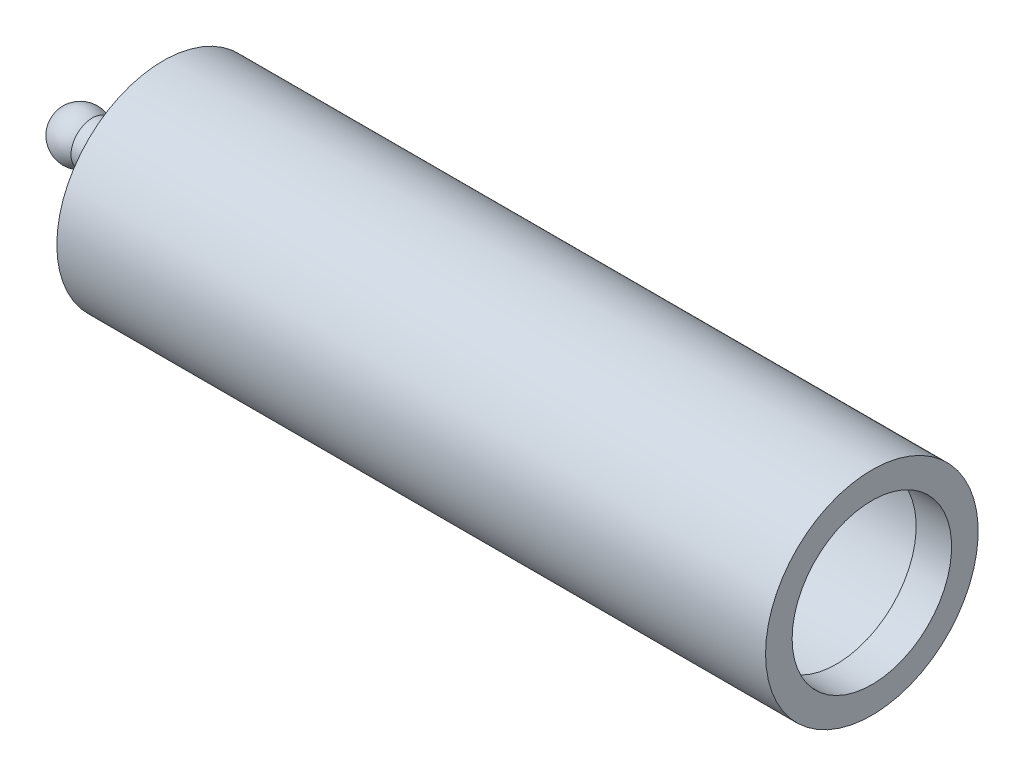
ISO-10303-21;
HEADER;
FILE_DESCRIPTION(('STEP AP214'),'2;1');
FILE_NAME('part.step','',(''),(''),'','','');
FILE_SCHEMA(('AUTOMOTIVE_DESIGN { 1 0 10303 214 1 1 1 1 }'));
ENDSEC;
DATA;
#1=APPLICATION_CONTEXT('core data for automotive mechanical design processes');
#2=APPLICATION_PROTOCOL_DEFINITION('international standard','automotive_design',2000,#1);
#3=PRODUCT_CONTEXT('',#1,'mechanical');
#4=PRODUCT('Part','Part','',(#3));
#5=PRODUCT_RELATED_PRODUCT_CATEGORY('part','',(#4));
#6=PRODUCT_DEFINITION_FORMATION('','',#4);
#7=PRODUCT_DEFINITION_CONTEXT('part definition',#1,'design');
#8=PRODUCT_DEFINITION('design','',#6,#7);
#9=PRODUCT_DEFINITION_SHAPE('','',#8);
#10=(LENGTH_UNIT() NAMED_UNIT(*) SI_UNIT(.MILLI.,.METRE.));
#11=(NAMED_UNIT(*) PLANE_ANGLE_UNIT() SI_UNIT($,.RADIAN.));
#12=(NAMED_UNIT(*) SI_UNIT($,.STERADIAN.) SOLID_ANGLE_UNIT());
#13=UNCERTAINTY_MEASURE_WITH_UNIT(LENGTH_MEASURE(1.E-05),#10,'distance_accuracy_value','');
#14=(GEOMETRIC_REPRESENTATION_CONTEXT(3) GLOBAL_UNCERTAINTY_ASSIGNED_CONTEXT((#13)) GLOBAL_UNIT_ASSIGNED_CONTEXT((#10,
#11,#12)) REPRESENTATION_CONTEXT('',''));
#15=CARTESIAN_POINT('',(0.,0.,0.));
#16=DIRECTION('',(0.,0.,1.));
#17=DIRECTION('',(1.,0.,0.));
#18=AXIS2_PLACEMENT_3D('',#15,#16,#17);
#19=CARTESIAN_POINT('',(-220.,0.,0.));
#20=DIRECTION('',(-1.,0.,0.));
#21=DIRECTION('',(0.,0.,1.));
#22=AXIS2_PLACEMENT_3D('',#19,#20,#21);
#23=CYLINDRICAL_SURFACE('',#22,55.);
#24=CARTESIAN_POINT('',(200.,0.,0.));
#25=DIRECTION('',(-1.,0.,0.));
#26=DIRECTION('',(0.,0.,1.));
#27=AXIS2_PLACEMENT_3D('',#24,#25,#26);
#28=CIRCLE('',#27,55.);
#29=CARTESIAN_POINT('',(200.,0.,55.));
#30=VERTEX_POINT('',#29);
#31=EDGE_CURVE('E58',#30,#30,#28,.T.);
#32=ORIENTED_EDGE('',*,*,#31,.F.);
#33=EDGE_LOOP('',(#32));
#34=FACE_BOUND('',#33,.T.);
#35=CARTESIAN_POINT('',(-160.,0.,0.));
#36=DIRECTION('',(-1.,0.,0.));
#37=DIRECTION('',(0.,0.,1.));
#38=AXIS2_PLACEMENT_3D('',#35,#36,#37);
#39=CIRCLE('',#38,55.);
#40=CARTESIAN_POINT('',(-160.,0.,55.));
#41=VERTEX_POINT('',#40);
#42=EDGE_CURVE('E10',#41,#41,#39,.T.);
#43=ORIENTED_EDGE('',*,*,#42,.T.);
#44=EDGE_LOOP('',(#43));
#45=FACE_BOUND('',#44,.T.);
#46=ADVANCED_FACE('F30',(#34,#45),#23,.F.);
#47=CARTESIAN_POINT('',(-160.,0.,0.));
#48=DIRECTION('',(-1.,0.,0.));
#49=DIRECTION('',(0.,0.,1.));
#50=AXIS2_PLACEMENT_3D('',#47,#48,#49);
#51=PLANE('',#50);
#52=ORIENTED_EDGE('',*,*,#42,.F.);
#53=EDGE_LOOP('',(#52));
#54=FACE_BOUND('',#53,.T.);
#55=ADVANCED_FACE('F65',(#54),#51,.F.);
#56=CARTESIAN_POINT('',(-220.,0.,0.));
#57=DIRECTION('',(-1.,0.,0.));
#58=DIRECTION('',(0.,0.,1.));
#59=AXIS2_PLACEMENT_3D('',#56,#57,#58);
#60=CYLINDRICAL_SURFACE('',#59,12.);
#61=CARTESIAN_POINT('',(-220.,0.,0.));
#62=DIRECTION('',(-1.,0.,0.));
#63=DIRECTION('',(0.,0.,1.));
#64=AXIS2_PLACEMENT_3D('',#61,#62,#63);
#65=CIRCLE('',#64,12.);
#66=CARTESIAN_POINT('',(-220.,0.,12.));
#67=VERTEX_POINT('',#66);
#68=EDGE_CURVE('E36',#67,#67,#65,.T.);
#69=ORIENTED_EDGE('',*,*,#68,.F.);
#70=EDGE_LOOP('',(#69));
#71=FACE_BOUND('',#70,.T.);
#72=CARTESIAN_POINT('',(-180.,0.,0.));
#73=DIRECTION('',(-1.,0.,0.));
#74=DIRECTION('',(0.,0.,1.));
#75=AXIS2_PLACEMENT_3D('',#72,#73,#74);
#76=CIRCLE('',#75,12.);
#77=CARTESIAN_POINT('',(-180.,0.,12.));
#78=VERTEX_POINT('',#77);
#79=EDGE_CURVE('E40',#78,#78,#76,.T.);
#80=ORIENTED_EDGE('',*,*,#79,.T.);
#81=EDGE_LOOP('',(#80));
#82=FACE_BOUND('',#81,.T.);
#83=ADVANCED_FACE('F69',(#71,#82),#60,.T.);
#84=CARTESIAN_POINT('',(-180.,60.,0.));
#85=DIRECTION('',(1.,0.,0.));
#86=DIRECTION('',(0.,0.,-1.));
#87=AXIS2_PLACEMENT_3D('',#84,#85,#86);
#88=PLANE('',#87);
#89=ORIENTED_EDGE('',*,*,#79,.F.);
#90=EDGE_LOOP('',(#89));
#91=FACE_BOUND('',#90,.T.);
#92=CARTESIAN_POINT('',(-180.,0.,0.));
#93=DIRECTION('',(-1.,0.,0.));
#94=DIRECTION('',(0.,0.,1.));
#95=AXIS2_PLACEMENT_3D('',#92,#93,#94);
#96=CIRCLE('',#95,60.);
#97=CARTESIAN_POINT('',(-180.,0.,60.));
#98=VERTEX_POINT('',#97);
#99=EDGE_CURVE('E44',#98,#98,#96,.T.);
#100=ORIENTED_EDGE('',*,*,#99,.T.);
#101=EDGE_LOOP('',(#100));
#102=FACE_BOUND('',#101,.T.);
#103=ADVANCED_FACE('F74',(#91,#102),#88,.F.);
#104=CARTESIAN_POINT('',(-220.,0.,0.));
#105=DIRECTION('',(-1.,0.,0.));
#106=DIRECTION('',(0.,0.,1.));
#107=AXIS2_PLACEMENT_3D('',#104,#105,#106);
#108=CYLINDRICAL_SURFACE('',#107,60.);
#109=ORIENTED_EDGE('',*,*,#99,.F.);
#110=EDGE_LOOP('',(#109));
#111=FACE_BOUND('',#110,.T.);
#112=CARTESIAN_POINT('',(220.,0.,0.));
#113=DIRECTION('',(-1.,0.,0.));
#114=DIRECTION('',(0.,0.,1.));
#115=AXIS2_PLACEMENT_3D('',#112,#113,#114);
#116=CIRCLE('',#115,60.);
#117=CARTESIAN_POINT('',(220.,0.,60.));
#118=VERTEX_POINT('',#117);
#119=EDGE_CURVE('E49',#118,#118,#116,.T.);
#120=ORIENTED_EDGE('',*,*,#119,.T.);
#121=EDGE_LOOP('',(#120));
#122=FACE_BOUND('',#121,.T.);
#123=ADVANCED_FACE('F80',(#111,#122),#108,.T.);
#124=CARTESIAN_POINT('',(220.,45.,0.));
#125=DIRECTION('',(-1.,0.,0.));
#126=DIRECTION('',(0.,0.,1.));
#127=AXIS2_PLACEMENT_3D('',#124,#125,#126);
#128=PLANE('',#127);
#129=ORIENTED_EDGE('',*,*,#119,.F.);
#130=EDGE_LOOP('',(#129));
#131=FACE_BOUND('',#130,.T.);
#132=CARTESIAN_POINT('',(220.,0.,0.));
#133=DIRECTION('',(-1.,0.,0.));
#134=DIRECTION('',(0.,0.,1.));
#135=AXIS2_PLACEMENT_3D('',#132,#133,#134);
#136=CIRCLE('',#135,45.);
#137=CARTESIAN_POINT('',(220.,0.,45.));
#138=VERTEX_POINT('',#137);
#139=EDGE_CURVE('E52',#138,#138,#136,.T.);
#140=ORIENTED_EDGE('',*,*,#139,.T.);
#141=EDGE_LOOP('',(#140));
#142=FACE_BOUND('',#141,.T.);
#143=ADVANCED_FACE('F84',(#131,#142),#128,.F.);
#144=CARTESIAN_POINT('',(-220.,0.,0.));
#145=DIRECTION('',(-1.,0.,0.));
#146=DIRECTION('',(0.,0.,1.));
#147=AXIS2_PLACEMENT_3D('',#144,#145,#146);
#148=CYLINDRICAL_SURFACE('',#147,45.);
#149=ORIENTED_EDGE('',*,*,#139,.F.);
#150=EDGE_LOOP('',(#149));
#151=FACE_BOUND('',#150,.T.);
#152=CARTESIAN_POINT('',(200.,0.,0.));
#153=DIRECTION('',(-1.,0.,0.));
#154=DIRECTION('',(0.,0.,1.));
#155=AXIS2_PLACEMENT_3D('',#152,#153,#154);
#156=CIRCLE('',#155,45.);
#157=CARTESIAN_POINT('',(200.,0.,45.));
#158=VERTEX_POINT('',#157);
#159=EDGE_CURVE('E55',#158,#158,#156,.T.);
#160=ORIENTED_EDGE('',*,*,#159,.T.);
#161=EDGE_LOOP('',(#160));
#162=FACE_BOUND('',#161,.T.);
#163=ADVANCED_FACE('F88',(#151,#162),#148,.F.);
#164=CARTESIAN_POINT('',(200.,55.,0.));
#165=DIRECTION('',(1.,0.,0.));
#166=DIRECTION('',(0.,0.,-1.));
#167=AXIS2_PLACEMENT_3D('',#164,#165,#166);
#168=PLANE('',#167);
#169=ORIENTED_EDGE('',*,*,#159,.F.);
#170=EDGE_LOOP('',(#169));
#171=FACE_BOUND('',#170,.T.);
#172=ORIENTED_EDGE('',*,*,#31,.T.);
#173=EDGE_LOOP('',(#172));
#174=FACE_BOUND('',#173,.T.);
#175=ADVANCED_FACE('F62',(#171,#174),#168,.F.);
#176=CARTESIAN_POINT('',(-226.733320132,0.,0.));
#177=DIRECTION('',(-1.,0.,0.));
#178=DIRECTION('',(0.,1.,0.));
#179=AXIS2_PLACEMENT_3D('',#176,#177,#178);
#180=SPHERICAL_SURFACE('',#179,13.76);
#181=ORIENTED_EDGE('',*,*,#68,.T.);
#182=EDGE_LOOP('',(#181));
#183=FACE_BOUND('',#182,.T.);
#184=ADVANCED_FACE('F95',(#183),#180,.T.);
#185=CLOSED_SHELL('',(#46,#55,#83,#103,#123,#143,#163,#175,#184));
#186=MANIFOLD_SOLID_BREP('B2',#185);
#187=ADVANCED_BREP_SHAPE_REPRESENTATION('',(#18,#186),#14);
#188=SHAPE_DEFINITION_REPRESENTATION(#9,#187);
ENDSEC;
END-ISO-10303-21;
